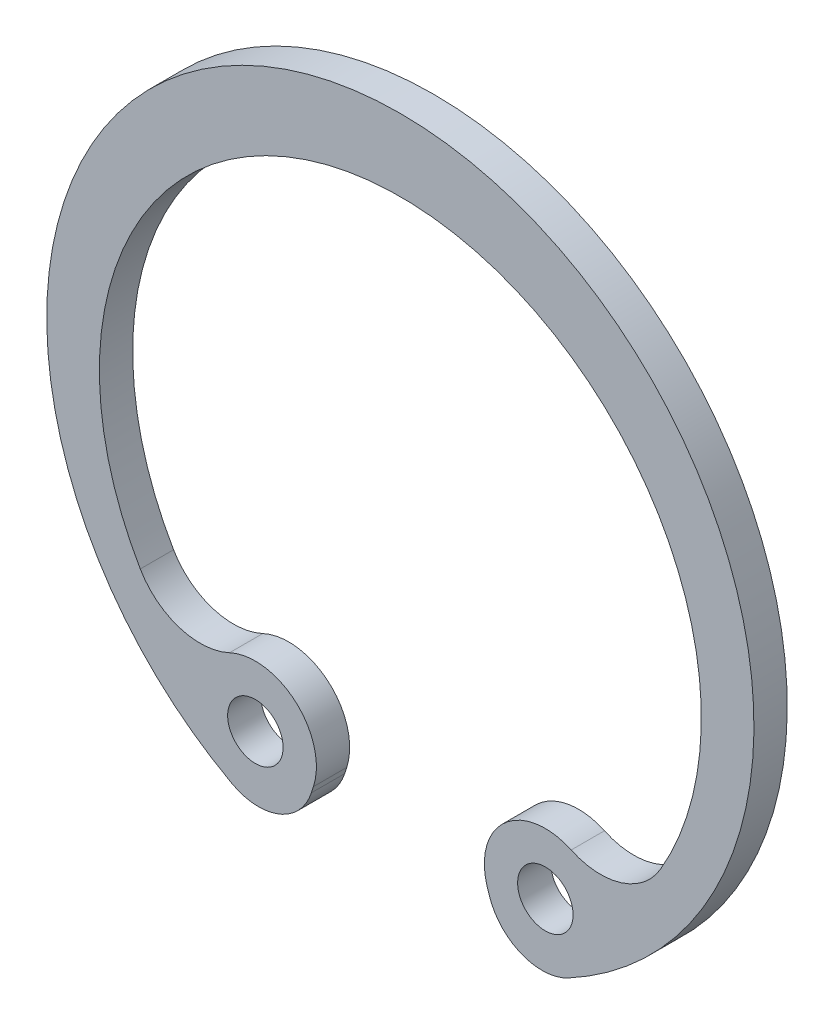
ISO-10303-21;
HEADER;
FILE_DESCRIPTION(('STEP AP214'),'2;1');
FILE_NAME('part.step','',(''),(''),'','','');
FILE_SCHEMA(('AUTOMOTIVE_DESIGN { 1 0 10303 214 1 1 1 1 }'));
ENDSEC;
DATA;
#1=APPLICATION_CONTEXT('core data for automotive mechanical design processes');
#2=APPLICATION_PROTOCOL_DEFINITION('international standard','automotive_design',2000,#1);
#3=PRODUCT_CONTEXT('',#1,'mechanical');
#4=PRODUCT('Part','Part','',(#3));
#5=PRODUCT_RELATED_PRODUCT_CATEGORY('part','',(#4));
#6=PRODUCT_DEFINITION_FORMATION('','',#4);
#7=PRODUCT_DEFINITION_CONTEXT('part definition',#1,'design');
#8=PRODUCT_DEFINITION('design','',#6,#7);
#9=PRODUCT_DEFINITION_SHAPE('','',#8);
#10=(LENGTH_UNIT() NAMED_UNIT(*) SI_UNIT(.MILLI.,.METRE.));
#11=(NAMED_UNIT(*) PLANE_ANGLE_UNIT() SI_UNIT($,.RADIAN.));
#12=(NAMED_UNIT(*) SI_UNIT($,.STERADIAN.) SOLID_ANGLE_UNIT());
#13=UNCERTAINTY_MEASURE_WITH_UNIT(LENGTH_MEASURE(1.E-05),#10,'distance_accuracy_value','');
#14=(GEOMETRIC_REPRESENTATION_CONTEXT(3) GLOBAL_UNCERTAINTY_ASSIGNED_CONTEXT((#13)) GLOBAL_UNIT_ASSIGNED_CONTEXT((#10,
#11,#12)) REPRESENTATION_CONTEXT('',''));
#15=CARTESIAN_POINT('',(0.,0.,0.));
#16=DIRECTION('',(0.,0.,1.));
#17=DIRECTION('',(1.,0.,0.));
#18=AXIS2_PLACEMENT_3D('',#15,#16,#17);
#19=CARTESIAN_POINT('',(-7.21779271503425,-4.90581584863427,1.2));
#20=DIRECTION('',(0.,0.,1.));
#21=DIRECTION('',(1.,0.,0.));
#22=AXIS2_PLACEMENT_3D('',#19,#20,#21);
#23=PLANE('',#22);
#24=CARTESIAN_POINT('',(-5.22777551683371,-9.16372983917777,1.2));
#25=DIRECTION('',(0.,0.,1.));
#26=DIRECTION('',(1.,0.,0.));
#27=AXIS2_PLACEMENT_3D('',#24,#25,#26);
#28=CIRCLE('',#27,1.);
#29=CARTESIAN_POINT('',(-4.22777551683371,-9.16372983917777,1.2));
#30=VERTEX_POINT('',#29);
#31=EDGE_CURVE('E147',#30,#30,#28,.T.);
#32=ORIENTED_EDGE('',*,*,#31,.F.);
#33=EDGE_LOOP('',(#32));
#34=FACE_BOUND('',#33,.T.);
#35=CARTESIAN_POINT('',(-7.21779271503425,-4.90581584863427,1.2));
#36=DIRECTION('',(0.,0.,-1.));
#37=DIRECTION('',(1.,0.,0.));
#38=AXIS2_PLACEMENT_3D('',#35,#36,#37);
#39=CIRCLE('',#38,2.5);
#40=CARTESIAN_POINT('',(-6.15927292875736,-7.17066371594464,1.2));
#41=VERTEX_POINT('',#40);
#42=CARTESIAN_POINT('',(-9.37816024355529,-6.16391447025017,1.2));
#43=VERTEX_POINT('',#42);
#44=EDGE_CURVE('E162',#41,#43,#39,.T.);
#45=ORIENTED_EDGE('',*,*,#44,.T.);
#46=CARTESIAN_POINT('',(0.,-0.702505557208832,1.2));
#47=DIRECTION('',(0.,0.,-1.));
#48=DIRECTION('',(1.,0.,0.));
#49=AXIS2_PLACEMENT_3D('',#46,#47,#48);
#50=CIRCLE('',#49,10.8525055572088);
#51=CARTESIAN_POINT('',(9.37816024355529,-6.16391447025017,1.2));
#52=VERTEX_POINT('',#51);
#53=EDGE_CURVE('E100',#43,#52,#50,.T.);
#54=ORIENTED_EDGE('',*,*,#53,.T.);
#55=CARTESIAN_POINT('',(7.21779271503425,-4.90581584863427,1.2));
#56=DIRECTION('',(0.,0.,-1.));
#57=DIRECTION('',(-1.,0.,0.));
#58=AXIS2_PLACEMENT_3D('',#55,#56,#57);
#59=CIRCLE('',#58,2.5);
#60=CARTESIAN_POINT('',(6.15927292875737,-7.17066371594464,1.2));
#61=VERTEX_POINT('',#60);
#62=EDGE_CURVE('E183',#52,#61,#59,.T.);
#63=ORIENTED_EDGE('',*,*,#62,.T.);
#64=CARTESIAN_POINT('',(5.22777551683371,-9.16372983917777,1.2));
#65=DIRECTION('',(0.,0.,1.));
#66=DIRECTION('',(-1.,0.,0.));
#67=AXIS2_PLACEMENT_3D('',#64,#65,#66);
#68=CIRCLE('',#67,2.2);
#69=CARTESIAN_POINT('',(3.13392226955012,-9.83884359169654,1.2));
#70=VERTEX_POINT('',#69);
#71=EDGE_CURVE('E202',#61,#70,#68,.T.);
#72=ORIENTED_EDGE('',*,*,#71,.T.);
#73=DIRECTION('',(0.306869887508533,-0.951751476037994,0.));
#74=VECTOR('',#73,1.);
#75=CARTESIAN_POINT('',(3.20859181286079,-10.070429846829,1.2));
#76=LINE('',#75,#74);
#77=CARTESIAN_POINT('',(3.20859181286079,-10.070429846829,1.2));
#78=VERTEX_POINT('',#77);
#79=EDGE_CURVE('E199',#70,#78,#76,.T.);
#80=ORIENTED_EDGE('',*,*,#79,.T.);
#81=CARTESIAN_POINT('',(5.11209476493678,-9.45669007181191,1.2));
#82=DIRECTION('',(0.,0.,1.));
#83=DIRECTION('',(-1.,0.,0.));
#84=AXIS2_PLACEMENT_3D('',#81,#82,#83);
#85=CIRCLE('',#84,2.);
#86=CARTESIAN_POINT('',(6.06318216306455,-11.2160742712188,1.2));
#87=VERTEX_POINT('',#86);
#88=EDGE_CURVE('E201',#78,#87,#85,.T.);
#89=ORIENTED_EDGE('',*,*,#88,.T.);
#90=CARTESIAN_POINT('',(0.,0.,1.2));
#91=DIRECTION('',(0.,0.,1.));
#92=DIRECTION('',(1.,0.,0.));
#93=AXIS2_PLACEMENT_3D('',#90,#91,#92);
#94=CIRCLE('',#93,12.75);
#95=CARTESIAN_POINT('',(-6.06318216306455,-11.2160742712188,1.2));
#96=VERTEX_POINT('',#95);
#97=EDGE_CURVE('E125',#87,#96,#94,.T.);
#98=ORIENTED_EDGE('',*,*,#97,.T.);
#99=CARTESIAN_POINT('',(-5.11209476493678,-9.45669007181191,1.2));
#100=DIRECTION('',(0.,0.,1.));
#101=DIRECTION('',(1.,0.,0.));
#102=AXIS2_PLACEMENT_3D('',#99,#100,#101);
#103=CIRCLE('',#102,2.);
#104=CARTESIAN_POINT('',(-3.20859181286079,-10.070429846829,1.2));
#105=VERTEX_POINT('',#104);
#106=EDGE_CURVE('E119',#96,#105,#103,.T.);
#107=ORIENTED_EDGE('',*,*,#106,.T.);
#108=DIRECTION('',(0.306869887508533,0.951751476037994,0.));
#109=VECTOR('',#108,1.);
#110=CARTESIAN_POINT('',(-3.20859181286079,-10.070429846829,1.2));
#111=LINE('',#110,#109);
#112=CARTESIAN_POINT('',(-3.13392226955012,-9.83884359169654,1.2));
#113=VERTEX_POINT('',#112);
#114=EDGE_CURVE('E123',#105,#113,#111,.T.);
#115=ORIENTED_EDGE('',*,*,#114,.T.);
#116=CARTESIAN_POINT('',(-5.22777551683371,-9.16372983917777,1.2));
#117=DIRECTION('',(0.,0.,1.));
#118=DIRECTION('',(1.,0.,0.));
#119=AXIS2_PLACEMENT_3D('',#116,#117,#118);
#120=CIRCLE('',#119,2.2);
#121=EDGE_CURVE('E51',#113,#41,#120,.T.);
#122=ORIENTED_EDGE('',*,*,#121,.T.);
#123=EDGE_LOOP('',(#45,#54,#63,#72,#80,#89,#98,#107,#115,#122));
#124=FACE_BOUND('',#123,.T.);
#125=CARTESIAN_POINT('',(5.22777551683371,-9.16372983917777,1.2));
#126=DIRECTION('',(0.,0.,1.));
#127=DIRECTION('',(-1.,0.,0.));
#128=AXIS2_PLACEMENT_3D('',#125,#126,#127);
#129=CIRCLE('',#128,1.);
#130=CARTESIAN_POINT('',(4.22777551683371,-9.16372983917777,1.2));
#131=VERTEX_POINT('',#130);
#132=EDGE_CURVE('E213',#131,#131,#129,.T.);
#133=ORIENTED_EDGE('',*,*,#132,.F.);
#134=EDGE_LOOP('',(#133));
#135=FACE_BOUND('',#134,.T.);
#136=ADVANCED_FACE('F34',(#34,#124,#135),#23,.T.);
#137=CARTESIAN_POINT('',(-7.21779271503425,-4.90581584863427,0.));
#138=DIRECTION('',(0.,0.,1.));
#139=DIRECTION('',(1.,0.,0.));
#140=AXIS2_PLACEMENT_3D('',#137,#138,#139);
#141=PLANE('',#140);
#142=CARTESIAN_POINT('',(-7.21779271503425,-4.90581584863427,0.));
#143=DIRECTION('',(0.,0.,-1.));
#144=DIRECTION('',(1.,0.,0.));
#145=AXIS2_PLACEMENT_3D('',#142,#143,#144);
#146=CIRCLE('',#145,2.5);
#147=CARTESIAN_POINT('',(-6.15927292875736,-7.17066371594464,0.));
#148=VERTEX_POINT('',#147);
#149=CARTESIAN_POINT('',(-9.37816024355529,-6.16391447025017,0.));
#150=VERTEX_POINT('',#149);
#151=EDGE_CURVE('E143',#148,#150,#146,.T.);
#152=ORIENTED_EDGE('',*,*,#151,.F.);
#153=CARTESIAN_POINT('',(-5.22777551683371,-9.16372983917777,0.));
#154=DIRECTION('',(0.,0.,1.));
#155=DIRECTION('',(1.,0.,0.));
#156=AXIS2_PLACEMENT_3D('',#153,#154,#155);
#157=CIRCLE('',#156,2.2);
#158=CARTESIAN_POINT('',(-3.13392226955012,-9.83884359169654,0.));
#159=VERTEX_POINT('',#158);
#160=EDGE_CURVE('E92',#159,#148,#157,.T.);
#161=ORIENTED_EDGE('',*,*,#160,.F.);
#162=DIRECTION('',(0.306869887508533,0.951751476037994,0.));
#163=VECTOR('',#162,1.);
#164=CARTESIAN_POINT('',(-3.20859181286079,-10.070429846829,0.));
#165=LINE('',#164,#163);
#166=CARTESIAN_POINT('',(-3.20859181286079,-10.070429846829,0.));
#167=VERTEX_POINT('',#166);
#168=EDGE_CURVE('E86',#167,#159,#165,.T.);
#169=ORIENTED_EDGE('',*,*,#168,.F.);
#170=CARTESIAN_POINT('',(-5.11209476493678,-9.45669007181191,0.));
#171=DIRECTION('',(0.,0.,1.));
#172=DIRECTION('',(1.,0.,0.));
#173=AXIS2_PLACEMENT_3D('',#170,#171,#172);
#174=CIRCLE('',#173,2.);
#175=CARTESIAN_POINT('',(-6.06318216306455,-11.2160742712188,0.));
#176=VERTEX_POINT('',#175);
#177=EDGE_CURVE('E133',#176,#167,#174,.T.);
#178=ORIENTED_EDGE('',*,*,#177,.F.);
#179=CARTESIAN_POINT('',(0.,0.,0.));
#180=DIRECTION('',(0.,0.,1.));
#181=DIRECTION('',(1.,0.,0.));
#182=AXIS2_PLACEMENT_3D('',#179,#180,#181);
#183=CIRCLE('',#182,12.75);
#184=CARTESIAN_POINT('',(6.06318216306455,-11.2160742712188,0.));
#185=VERTEX_POINT('',#184);
#186=EDGE_CURVE('E157',#185,#176,#183,.T.);
#187=ORIENTED_EDGE('',*,*,#186,.F.);
#188=CARTESIAN_POINT('',(5.11209476493678,-9.45669007181191,0.));
#189=DIRECTION('',(0.,0.,1.));
#190=DIRECTION('',(-1.,0.,0.));
#191=AXIS2_PLACEMENT_3D('',#188,#189,#190);
#192=CIRCLE('',#191,2.);
#193=CARTESIAN_POINT('',(3.20859181286079,-10.070429846829,0.));
#194=VERTEX_POINT('',#193);
#195=EDGE_CURVE('E155',#194,#185,#192,.T.);
#196=ORIENTED_EDGE('',*,*,#195,.F.);
#197=DIRECTION('',(0.306869887508533,-0.951751476037994,0.));
#198=VECTOR('',#197,1.);
#199=CARTESIAN_POINT('',(3.20859181286079,-10.070429846829,0.));
#200=LINE('',#199,#198);
#201=CARTESIAN_POINT('',(3.13392226955012,-9.83884359169654,0.));
#202=VERTEX_POINT('',#201);
#203=EDGE_CURVE('E153',#202,#194,#200,.T.);
#204=ORIENTED_EDGE('',*,*,#203,.F.);
#205=CARTESIAN_POINT('',(5.22777551683371,-9.16372983917777,0.));
#206=DIRECTION('',(0.,0.,1.));
#207=DIRECTION('',(-1.,0.,0.));
#208=AXIS2_PLACEMENT_3D('',#205,#206,#207);
#209=CIRCLE('',#208,2.2);
#210=CARTESIAN_POINT('',(6.15927292875737,-7.17066371594464,0.));
#211=VERTEX_POINT('',#210);
#212=EDGE_CURVE('E151',#211,#202,#209,.T.);
#213=ORIENTED_EDGE('',*,*,#212,.F.);
#214=CARTESIAN_POINT('',(7.21779271503425,-4.90581584863427,0.));
#215=DIRECTION('',(0.,0.,-1.));
#216=DIRECTION('',(-1.,0.,0.));
#217=AXIS2_PLACEMENT_3D('',#214,#215,#216);
#218=CIRCLE('',#217,2.5);
#219=CARTESIAN_POINT('',(9.37816024355529,-6.16391447025017,0.));
#220=VERTEX_POINT('',#219);
#221=EDGE_CURVE('E149',#220,#211,#218,.T.);
#222=ORIENTED_EDGE('',*,*,#221,.F.);
#223=CARTESIAN_POINT('',(0.,-0.702505557208832,0.));
#224=DIRECTION('',(0.,0.,-1.));
#225=DIRECTION('',(1.,0.,0.));
#226=AXIS2_PLACEMENT_3D('',#223,#224,#225);
#227=CIRCLE('',#226,10.8525055572088);
#228=EDGE_CURVE('E146',#150,#220,#227,.T.);
#229=ORIENTED_EDGE('',*,*,#228,.F.);
#230=EDGE_LOOP('',(#152,#161,#169,#178,#187,#196,#204,#213,#222,#229));
#231=FACE_BOUND('',#230,.T.);
#232=CARTESIAN_POINT('',(-5.22777551683371,-9.16372983917777,0.));
#233=DIRECTION('',(0.,0.,1.));
#234=DIRECTION('',(1.,0.,0.));
#235=AXIS2_PLACEMENT_3D('',#232,#233,#234);
#236=CIRCLE('',#235,1.);
#237=CARTESIAN_POINT('',(-4.22777551683371,-9.16372983917777,0.));
#238=VERTEX_POINT('',#237);
#239=EDGE_CURVE('E210',#238,#238,#236,.T.);
#240=ORIENTED_EDGE('',*,*,#239,.T.);
#241=EDGE_LOOP('',(#240));
#242=FACE_BOUND('',#241,.T.);
#243=CARTESIAN_POINT('',(5.22777551683371,-9.16372983917777,0.));
#244=DIRECTION('',(0.,0.,1.));
#245=DIRECTION('',(-1.,0.,0.));
#246=AXIS2_PLACEMENT_3D('',#243,#244,#245);
#247=CIRCLE('',#246,1.);
#248=CARTESIAN_POINT('',(4.22777551683371,-9.16372983917777,0.));
#249=VERTEX_POINT('',#248);
#250=EDGE_CURVE('E216',#249,#249,#247,.T.);
#251=ORIENTED_EDGE('',*,*,#250,.T.);
#252=EDGE_LOOP('',(#251));
#253=FACE_BOUND('',#252,.T.);
#254=ADVANCED_FACE('F187',(#231,#242,#253),#141,.F.);
#255=CARTESIAN_POINT('',(-7.21779271503425,-4.90581584863427,1.2));
#256=DIRECTION('',(0.,0.,-1.));
#257=DIRECTION('',(-1.,0.,0.));
#258=AXIS2_PLACEMENT_3D('',#255,#256,#257);
#259=CYLINDRICAL_SURFACE('',#258,2.5);
#260=ORIENTED_EDGE('',*,*,#151,.T.);
#261=DIRECTION('',(0.,0.,-1.));
#262=VECTOR('',#261,1.);
#263=CARTESIAN_POINT('',(-9.37816024355529,-6.16391447025017,1.2));
#264=LINE('',#263,#262);
#265=EDGE_CURVE('E11',#43,#150,#264,.T.);
#266=ORIENTED_EDGE('',*,*,#265,.F.);
#267=ORIENTED_EDGE('',*,*,#44,.F.);
#268=DIRECTION('',(0.,0.,-1.));
#269=VECTOR('',#268,1.);
#270=CARTESIAN_POINT('',(-6.15927292875736,-7.17066371594464,1.2));
#271=LINE('',#270,#269);
#272=EDGE_CURVE('E139',#41,#148,#271,.T.);
#273=ORIENTED_EDGE('',*,*,#272,.T.);
#274=EDGE_LOOP('',(#260,#266,#267,#273));
#275=FACE_BOUND('',#274,.T.);
#276=ADVANCED_FACE('F36',(#275),#259,.F.);
#277=CARTESIAN_POINT('',(0.,-0.702505557208832,1.2));
#278=DIRECTION('',(0.,0.,-1.));
#279=DIRECTION('',(-1.,0.,0.));
#280=AXIS2_PLACEMENT_3D('',#277,#278,#279);
#281=CYLINDRICAL_SURFACE('',#280,10.8525055572088);
#282=ORIENTED_EDGE('',*,*,#228,.T.);
#283=DIRECTION('',(0.,0.,-1.));
#284=VECTOR('',#283,1.);
#285=CARTESIAN_POINT('',(9.37816024355529,-6.16391447025017,1.2));
#286=LINE('',#285,#284);
#287=EDGE_CURVE('E43',#52,#220,#286,.T.);
#288=ORIENTED_EDGE('',*,*,#287,.F.);
#289=ORIENTED_EDGE('',*,*,#53,.F.);
#290=ORIENTED_EDGE('',*,*,#265,.T.);
#291=EDGE_LOOP('',(#282,#288,#289,#290));
#292=FACE_BOUND('',#291,.T.);
#293=ADVANCED_FACE('F256',(#292),#281,.F.);
#294=CARTESIAN_POINT('',(7.21779271503425,-4.90581584863427,1.2));
#295=DIRECTION('',(0.,0.,-1.));
#296=DIRECTION('',(-1.,0.,0.));
#297=AXIS2_PLACEMENT_3D('',#294,#295,#296);
#298=CYLINDRICAL_SURFACE('',#297,2.5);
#299=ORIENTED_EDGE('',*,*,#221,.T.);
#300=DIRECTION('',(0.,0.,-1.));
#301=VECTOR('',#300,1.);
#302=CARTESIAN_POINT('',(6.15927292875737,-7.17066371594464,1.2));
#303=LINE('',#302,#301);
#304=EDGE_CURVE('E175',#61,#211,#303,.T.);
#305=ORIENTED_EDGE('',*,*,#304,.F.);
#306=ORIENTED_EDGE('',*,*,#62,.F.);
#307=ORIENTED_EDGE('',*,*,#287,.T.);
#308=EDGE_LOOP('',(#299,#305,#306,#307));
#309=FACE_BOUND('',#308,.T.);
#310=ADVANCED_FACE('F181',(#309),#298,.F.);
#311=CARTESIAN_POINT('',(5.22777551683371,-9.16372983917777,1.2));
#312=DIRECTION('',(0.,0.,-1.));
#313=DIRECTION('',(-1.,0.,0.));
#314=AXIS2_PLACEMENT_3D('',#311,#312,#313);
#315=CYLINDRICAL_SURFACE('',#314,2.2);
#316=ORIENTED_EDGE('',*,*,#212,.T.);
#317=DIRECTION('',(0.,0.,-1.));
#318=VECTOR('',#317,1.);
#319=CARTESIAN_POINT('',(3.13392226955012,-9.83884359169654,1.2));
#320=LINE('',#319,#318);
#321=EDGE_CURVE('E172',#70,#202,#320,.T.);
#322=ORIENTED_EDGE('',*,*,#321,.F.);
#323=ORIENTED_EDGE('',*,*,#71,.F.);
#324=ORIENTED_EDGE('',*,*,#304,.T.);
#325=EDGE_LOOP('',(#316,#322,#323,#324));
#326=FACE_BOUND('',#325,.T.);
#327=ADVANCED_FACE('F193',(#326),#315,.T.);
#328=CARTESIAN_POINT('',(3.20859181286079,-10.070429846829,1.2));
#329=DIRECTION('',(0.951751476037994,0.306869887508533,0.));
#330=DIRECTION('',(-0.306869887508533,0.951751476037994,0.));
#331=AXIS2_PLACEMENT_3D('',#328,#329,#330);
#332=PLANE('',#331);
#333=ORIENTED_EDGE('',*,*,#203,.T.);
#334=DIRECTION('',(0.,0.,-1.));
#335=VECTOR('',#334,1.);
#336=CARTESIAN_POINT('',(3.20859181286079,-10.070429846829,1.2));
#337=LINE('',#336,#335);
#338=EDGE_CURVE('E169',#78,#194,#337,.T.);
#339=ORIENTED_EDGE('',*,*,#338,.F.);
#340=ORIENTED_EDGE('',*,*,#79,.F.);
#341=ORIENTED_EDGE('',*,*,#321,.T.);
#342=EDGE_LOOP('',(#333,#339,#340,#341));
#343=FACE_BOUND('',#342,.T.);
#344=ADVANCED_FACE('F197',(#343),#332,.F.);
#345=CARTESIAN_POINT('',(5.11209476493678,-9.45669007181191,1.2));
#346=DIRECTION('',(0.,0.,-1.));
#347=DIRECTION('',(-1.,0.,0.));
#348=AXIS2_PLACEMENT_3D('',#345,#346,#347);
#349=CYLINDRICAL_SURFACE('',#348,2.);
#350=ORIENTED_EDGE('',*,*,#195,.T.);
#351=DIRECTION('',(0.,0.,-1.));
#352=VECTOR('',#351,1.);
#353=CARTESIAN_POINT('',(6.06318216306455,-11.2160742712188,1.2));
#354=LINE('',#353,#352);
#355=EDGE_CURVE('E166',#87,#185,#354,.T.);
#356=ORIENTED_EDGE('',*,*,#355,.F.);
#357=ORIENTED_EDGE('',*,*,#88,.F.);
#358=ORIENTED_EDGE('',*,*,#338,.T.);
#359=EDGE_LOOP('',(#350,#356,#357,#358));
#360=FACE_BOUND('',#359,.T.);
#361=ADVANCED_FACE('F246',(#360),#349,.T.);
#362=CARTESIAN_POINT('',(0.,0.,1.2));
#363=DIRECTION('',(0.,0.,-1.));
#364=DIRECTION('',(-1.,0.,0.));
#365=AXIS2_PLACEMENT_3D('',#362,#363,#364);
#366=CYLINDRICAL_SURFACE('',#365,12.75);
#367=ORIENTED_EDGE('',*,*,#186,.T.);
#368=DIRECTION('',(0.,0.,-1.));
#369=VECTOR('',#368,1.);
#370=CARTESIAN_POINT('',(-6.06318216306455,-11.2160742712188,1.2));
#371=LINE('',#370,#369);
#372=EDGE_CURVE('E134',#96,#176,#371,.T.);
#373=ORIENTED_EDGE('',*,*,#372,.F.);
#374=ORIENTED_EDGE('',*,*,#97,.F.);
#375=ORIENTED_EDGE('',*,*,#355,.T.);
#376=EDGE_LOOP('',(#367,#373,#374,#375));
#377=FACE_BOUND('',#376,.T.);
#378=ADVANCED_FACE('F243',(#377),#366,.T.);
#379=CARTESIAN_POINT('',(-5.11209476493678,-9.45669007181191,1.2));
#380=DIRECTION('',(0.,0.,-1.));
#381=DIRECTION('',(-1.,0.,0.));
#382=AXIS2_PLACEMENT_3D('',#379,#380,#381);
#383=CYLINDRICAL_SURFACE('',#382,2.);
#384=ORIENTED_EDGE('',*,*,#177,.T.);
#385=DIRECTION('',(0.,0.,-1.));
#386=VECTOR('',#385,1.);
#387=CARTESIAN_POINT('',(-3.20859181286079,-10.070429846829,1.2));
#388=LINE('',#387,#386);
#389=EDGE_CURVE('E130',#105,#167,#388,.T.);
#390=ORIENTED_EDGE('',*,*,#389,.F.);
#391=ORIENTED_EDGE('',*,*,#106,.F.);
#392=ORIENTED_EDGE('',*,*,#372,.T.);
#393=EDGE_LOOP('',(#384,#390,#391,#392));
#394=FACE_BOUND('',#393,.T.);
#395=ADVANCED_FACE('F131',(#394),#383,.T.);
#396=CARTESIAN_POINT('',(-3.20859181286079,-10.070429846829,1.2));
#397=DIRECTION('',(-0.951751476037994,0.306869887508533,0.));
#398=DIRECTION('',(-0.306869887508533,-0.951751476037994,0.));
#399=AXIS2_PLACEMENT_3D('',#396,#397,#398);
#400=PLANE('',#399);
#401=ORIENTED_EDGE('',*,*,#168,.T.);
#402=DIRECTION('',(0.,0.,-1.));
#403=VECTOR('',#402,1.);
#404=CARTESIAN_POINT('',(-3.13392226955012,-9.83884359169654,1.2));
#405=LINE('',#404,#403);
#406=EDGE_CURVE('E135',#113,#159,#405,.T.);
#407=ORIENTED_EDGE('',*,*,#406,.F.);
#408=ORIENTED_EDGE('',*,*,#114,.F.);
#409=ORIENTED_EDGE('',*,*,#389,.T.);
#410=EDGE_LOOP('',(#401,#407,#408,#409));
#411=FACE_BOUND('',#410,.T.);
#412=ADVANCED_FACE('F137',(#411),#400,.F.);
#413=CARTESIAN_POINT('',(-5.22777551683371,-9.16372983917777,1.2));
#414=DIRECTION('',(0.,0.,-1.));
#415=DIRECTION('',(-1.,0.,0.));
#416=AXIS2_PLACEMENT_3D('',#413,#414,#415);
#417=CYLINDRICAL_SURFACE('',#416,2.2);
#418=ORIENTED_EDGE('',*,*,#160,.T.);
#419=ORIENTED_EDGE('',*,*,#272,.F.);
#420=ORIENTED_EDGE('',*,*,#121,.F.);
#421=ORIENTED_EDGE('',*,*,#406,.T.);
#422=EDGE_LOOP('',(#418,#419,#420,#421));
#423=FACE_BOUND('',#422,.T.);
#424=ADVANCED_FACE('F236',(#423),#417,.T.);
#425=CARTESIAN_POINT('',(-5.22777551683371,-9.16372983917777,1.2));
#426=DIRECTION('',(0.,0.,-1.));
#427=DIRECTION('',(-1.,0.,0.));
#428=AXIS2_PLACEMENT_3D('',#425,#426,#427);
#429=CYLINDRICAL_SURFACE('',#428,1.);
#430=ORIENTED_EDGE('',*,*,#31,.T.);
#431=EDGE_LOOP('',(#430));
#432=FACE_BOUND('',#431,.T.);
#433=ORIENTED_EDGE('',*,*,#239,.F.);
#434=EDGE_LOOP('',(#433));
#435=FACE_BOUND('',#434,.T.);
#436=ADVANCED_FACE('F233',(#432,#435),#429,.F.);
#437=CARTESIAN_POINT('',(5.22777551683371,-9.16372983917777,1.2));
#438=DIRECTION('',(0.,0.,-1.));
#439=DIRECTION('',(-1.,0.,0.));
#440=AXIS2_PLACEMENT_3D('',#437,#438,#439);
#441=CYLINDRICAL_SURFACE('',#440,1.);
#442=ORIENTED_EDGE('',*,*,#132,.T.);
#443=EDGE_LOOP('',(#442));
#444=FACE_BOUND('',#443,.T.);
#445=ORIENTED_EDGE('',*,*,#250,.F.);
#446=EDGE_LOOP('',(#445));
#447=FACE_BOUND('',#446,.T.);
#448=ADVANCED_FACE('F222',(#444,#447),#441,.F.);
#449=CLOSED_SHELL('',(#136,#254,#276,#293,#310,#327,#344,#361,#378,#395,#412,#424,#436,#448));
#450=MANIFOLD_SOLID_BREP('B2',#449);
#451=ADVANCED_BREP_SHAPE_REPRESENTATION('',(#18,#450),#14);
#452=SHAPE_DEFINITION_REPRESENTATION(#9,#451);
ENDSEC;
END-ISO-10303-21;
